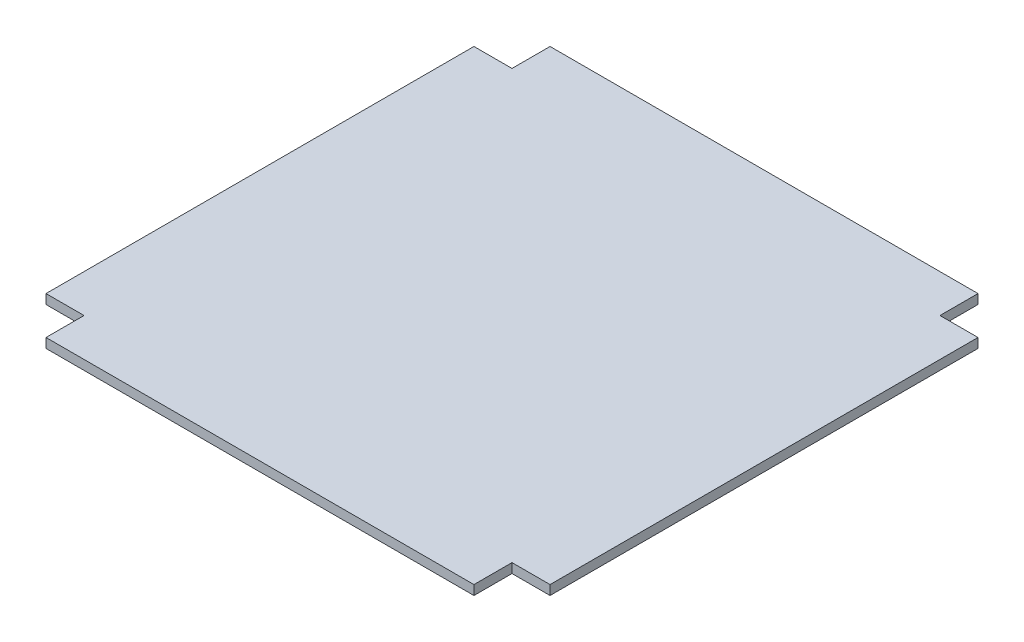
ISO-10303-21;
HEADER;
FILE_DESCRIPTION(('STEP AP214'),'2;1');
FILE_NAME('part.step','',(''),(''),'','','');
FILE_SCHEMA(('AUTOMOTIVE_DESIGN { 1 0 10303 214 1 1 1 1 }'));
ENDSEC;
DATA;
#1=APPLICATION_CONTEXT('core data for automotive mechanical design processes');
#2=APPLICATION_PROTOCOL_DEFINITION('international standard','automotive_design',2000,#1);
#3=PRODUCT_CONTEXT('',#1,'mechanical');
#4=PRODUCT('Part','Part','',(#3));
#5=PRODUCT_RELATED_PRODUCT_CATEGORY('part','',(#4));
#6=PRODUCT_DEFINITION_FORMATION('','',#4);
#7=PRODUCT_DEFINITION_CONTEXT('part definition',#1,'design');
#8=PRODUCT_DEFINITION('design','',#6,#7);
#9=PRODUCT_DEFINITION_SHAPE('','',#8);
#10=(LENGTH_UNIT() NAMED_UNIT(*) SI_UNIT(.MILLI.,.METRE.));
#11=(NAMED_UNIT(*) PLANE_ANGLE_UNIT() SI_UNIT($,.RADIAN.));
#12=(NAMED_UNIT(*) SI_UNIT($,.STERADIAN.) SOLID_ANGLE_UNIT());
#13=UNCERTAINTY_MEASURE_WITH_UNIT(LENGTH_MEASURE(1.E-05),#10,'distance_accuracy_value','');
#14=(GEOMETRIC_REPRESENTATION_CONTEXT(3) GLOBAL_UNCERTAINTY_ASSIGNED_CONTEXT((#13)) GLOBAL_UNIT_ASSIGNED_CONTEXT((#10,
#11,#12)) REPRESENTATION_CONTEXT('',''));
#15=CARTESIAN_POINT('',(0.,0.,0.));
#16=DIRECTION('',(0.,0.,1.));
#17=DIRECTION('',(1.,0.,0.));
#18=AXIS2_PLACEMENT_3D('',#15,#16,#17);
#19=CARTESIAN_POINT('',(265.,10.,265.));
#20=DIRECTION('',(-1.,0.,0.));
#21=DIRECTION('',(0.,0.,1.));
#22=AXIS2_PLACEMENT_3D('',#19,#20,#21);
#23=PLANE('',#22);
#24=DIRECTION('',(0.,0.,-1.));
#25=VECTOR('',#24,1.);
#26=CARTESIAN_POINT('',(265.,0.,265.));
#27=LINE('',#26,#25);
#28=CARTESIAN_POINT('',(265.,0.,225.));
#29=VERTEX_POINT('',#28);
#30=CARTESIAN_POINT('',(265.,0.,-225.));
#31=VERTEX_POINT('',#30);
#32=EDGE_CURVE('E144',#29,#31,#27,.T.);
#33=ORIENTED_EDGE('',*,*,#32,.T.);
#34=DIRECTION('',(0.,1.,0.));
#35=VECTOR('',#34,1.);
#36=CARTESIAN_POINT('',(265.,0.,-225.));
#37=LINE('',#36,#35);
#38=CARTESIAN_POINT('',(265.,10.,-225.));
#39=VERTEX_POINT('',#38);
#40=EDGE_CURVE('E211',#31,#39,#37,.T.);
#41=ORIENTED_EDGE('',*,*,#40,.T.);
#42=DIRECTION('',(0.,0.,-1.));
#43=VECTOR('',#42,1.);
#44=CARTESIAN_POINT('',(265.,10.,265.));
#45=LINE('',#44,#43);
#46=CARTESIAN_POINT('',(265.,10.,225.));
#47=VERTEX_POINT('',#46);
#48=EDGE_CURVE('E146',#47,#39,#45,.T.);
#49=ORIENTED_EDGE('',*,*,#48,.F.);
#50=DIRECTION('',(0.,1.,0.));
#51=VECTOR('',#50,1.);
#52=CARTESIAN_POINT('',(265.,0.,225.));
#53=LINE('',#52,#51);
#54=EDGE_CURVE('E131',#29,#47,#53,.T.);
#55=ORIENTED_EDGE('',*,*,#54,.F.);
#56=EDGE_LOOP('',(#33,#41,#49,#55));
#57=FACE_BOUND('',#56,.T.);
#58=ADVANCED_FACE('F37',(#57),#23,.F.);
#59=CARTESIAN_POINT('',(-265.,10.,-265.));
#60=DIRECTION('',(0.,0.,1.));
#61=DIRECTION('',(1.,0.,0.));
#62=AXIS2_PLACEMENT_3D('',#59,#60,#61);
#63=PLANE('',#62);
#64=DIRECTION('',(-1.,0.,0.));
#65=VECTOR('',#64,1.);
#66=CARTESIAN_POINT('',(-265.,10.,-265.));
#67=LINE('',#66,#65);
#68=CARTESIAN_POINT('',(225.,10.,-265.));
#69=VERTEX_POINT('',#68);
#70=CARTESIAN_POINT('',(-225.,10.,-265.));
#71=VERTEX_POINT('',#70);
#72=EDGE_CURVE('E170',#69,#71,#67,.T.);
#73=ORIENTED_EDGE('',*,*,#72,.F.);
#74=DIRECTION('',(0.,1.,0.));
#75=VECTOR('',#74,1.);
#76=CARTESIAN_POINT('',(225.,0.,-265.));
#77=LINE('',#76,#75);
#78=CARTESIAN_POINT('',(225.,0.,-265.));
#79=VERTEX_POINT('',#78);
#80=EDGE_CURVE('E234',#79,#69,#77,.T.);
#81=ORIENTED_EDGE('',*,*,#80,.F.);
#82=DIRECTION('',(-1.,0.,0.));
#83=VECTOR('',#82,1.);
#84=CARTESIAN_POINT('',(-265.,0.,-265.));
#85=LINE('',#84,#83);
#86=CARTESIAN_POINT('',(-225.,0.,-265.));
#87=VERTEX_POINT('',#86);
#88=EDGE_CURVE('E150',#79,#87,#85,.T.);
#89=ORIENTED_EDGE('',*,*,#88,.T.);
#90=DIRECTION('',(0.,1.,0.));
#91=VECTOR('',#90,1.);
#92=CARTESIAN_POINT('',(-225.,0.,-265.));
#93=LINE('',#92,#91);
#94=EDGE_CURVE('E151',#87,#71,#93,.T.);
#95=ORIENTED_EDGE('',*,*,#94,.T.);
#96=EDGE_LOOP('',(#73,#81,#89,#95));
#97=FACE_BOUND('',#96,.T.);
#98=ADVANCED_FACE('F245',(#97),#63,.F.);
#99=CARTESIAN_POINT('',(-265.,10.,265.));
#100=DIRECTION('',(1.,0.,0.));
#101=DIRECTION('',(0.,0.,-1.));
#102=AXIS2_PLACEMENT_3D('',#99,#100,#101);
#103=PLANE('',#102);
#104=DIRECTION('',(0.,0.,1.));
#105=VECTOR('',#104,1.);
#106=CARTESIAN_POINT('',(-265.,0.,265.));
#107=LINE('',#106,#105);
#108=CARTESIAN_POINT('',(-265.,0.,-225.));
#109=VERTEX_POINT('',#108);
#110=CARTESIAN_POINT('',(-265.,0.,225.));
#111=VERTEX_POINT('',#110);
#112=EDGE_CURVE('E154',#109,#111,#107,.T.);
#113=ORIENTED_EDGE('',*,*,#112,.T.);
#114=DIRECTION('',(0.,1.,0.));
#115=VECTOR('',#114,1.);
#116=CARTESIAN_POINT('',(-265.,0.,225.));
#117=LINE('',#116,#115);
#118=CARTESIAN_POINT('',(-265.,10.,225.));
#119=VERTEX_POINT('',#118);
#120=EDGE_CURVE('E190',#111,#119,#117,.T.);
#121=ORIENTED_EDGE('',*,*,#120,.T.);
#122=DIRECTION('',(0.,0.,1.));
#123=VECTOR('',#122,1.);
#124=CARTESIAN_POINT('',(-265.,10.,265.));
#125=LINE('',#124,#123);
#126=CARTESIAN_POINT('',(-265.,10.,-225.));
#127=VERTEX_POINT('',#126);
#128=EDGE_CURVE('E45',#127,#119,#125,.T.);
#129=ORIENTED_EDGE('',*,*,#128,.F.);
#130=DIRECTION('',(0.,1.,0.));
#131=VECTOR('',#130,1.);
#132=CARTESIAN_POINT('',(-265.,0.,-225.));
#133=LINE('',#132,#131);
#134=EDGE_CURVE('E177',#109,#127,#133,.T.);
#135=ORIENTED_EDGE('',*,*,#134,.F.);
#136=EDGE_LOOP('',(#113,#121,#129,#135));
#137=FACE_BOUND('',#136,.T.);
#138=ADVANCED_FACE('F189',(#137),#103,.F.);
#139=CARTESIAN_POINT('',(-265.,10.,265.));
#140=DIRECTION('',(0.,0.,-1.));
#141=DIRECTION('',(-1.,0.,0.));
#142=AXIS2_PLACEMENT_3D('',#139,#140,#141);
#143=PLANE('',#142);
#144=DIRECTION('',(1.,0.,0.));
#145=VECTOR('',#144,1.);
#146=CARTESIAN_POINT('',(-265.,10.,265.));
#147=LINE('',#146,#145);
#148=CARTESIAN_POINT('',(-225.,10.,265.));
#149=VERTEX_POINT('',#148);
#150=CARTESIAN_POINT('',(225.,10.,265.));
#151=VERTEX_POINT('',#150);
#152=EDGE_CURVE('E11',#149,#151,#147,.T.);
#153=ORIENTED_EDGE('',*,*,#152,.F.);
#154=DIRECTION('',(0.,1.,0.));
#155=VECTOR('',#154,1.);
#156=CARTESIAN_POINT('',(-225.,0.,265.));
#157=LINE('',#156,#155);
#158=CARTESIAN_POINT('',(-225.,0.,265.));
#159=VERTEX_POINT('',#158);
#160=EDGE_CURVE('E197',#159,#149,#157,.T.);
#161=ORIENTED_EDGE('',*,*,#160,.F.);
#162=DIRECTION('',(1.,0.,0.));
#163=VECTOR('',#162,1.);
#164=CARTESIAN_POINT('',(-265.,0.,265.));
#165=LINE('',#164,#163);
#166=CARTESIAN_POINT('',(225.,0.,265.));
#167=VERTEX_POINT('',#166);
#168=EDGE_CURVE('E40',#159,#167,#165,.T.);
#169=ORIENTED_EDGE('',*,*,#168,.T.);
#170=DIRECTION('',(0.,1.,0.));
#171=VECTOR('',#170,1.);
#172=CARTESIAN_POINT('',(225.,0.,265.));
#173=LINE('',#172,#171);
#174=EDGE_CURVE('E224',#167,#151,#173,.T.);
#175=ORIENTED_EDGE('',*,*,#174,.T.);
#176=EDGE_LOOP('',(#153,#161,#169,#175));
#177=FACE_BOUND('',#176,.T.);
#178=ADVANCED_FACE('F264',(#177),#143,.F.);
#179=CARTESIAN_POINT('',(0.,10.,0.));
#180=DIRECTION('',(0.,-1.,0.));
#181=DIRECTION('',(0.,0.,-1.));
#182=AXIS2_PLACEMENT_3D('',#179,#180,#181);
#183=PLANE('',#182);
#184=ORIENTED_EDGE('',*,*,#48,.T.);
#185=DIRECTION('',(1.,0.,0.));
#186=VECTOR('',#185,1.);
#187=CARTESIAN_POINT('',(265.,10.,-225.));
#188=LINE('',#187,#186);
#189=CARTESIAN_POINT('',(225.,10.,-225.));
#190=VERTEX_POINT('',#189);
#191=EDGE_CURVE('E195',#190,#39,#188,.T.);
#192=ORIENTED_EDGE('',*,*,#191,.F.);
#193=DIRECTION('',(0.,0.,1.));
#194=VECTOR('',#193,1.);
#195=CARTESIAN_POINT('',(225.,10.,-265.));
#196=LINE('',#195,#194);
#197=EDGE_CURVE('E191',#69,#190,#196,.T.);
#198=ORIENTED_EDGE('',*,*,#197,.F.);
#199=ORIENTED_EDGE('',*,*,#72,.T.);
#200=DIRECTION('',(0.,0.,-1.));
#201=VECTOR('',#200,1.);
#202=CARTESIAN_POINT('',(-225.,10.,-265.));
#203=LINE('',#202,#201);
#204=CARTESIAN_POINT('',(-225.,10.,-225.));
#205=VERTEX_POINT('',#204);
#206=EDGE_CURVE('E207',#205,#71,#203,.T.);
#207=ORIENTED_EDGE('',*,*,#206,.F.);
#208=DIRECTION('',(1.,0.,0.));
#209=VECTOR('',#208,1.);
#210=CARTESIAN_POINT('',(-265.,10.,-225.));
#211=LINE('',#210,#209);
#212=EDGE_CURVE('E188',#127,#205,#211,.T.);
#213=ORIENTED_EDGE('',*,*,#212,.F.);
#214=ORIENTED_EDGE('',*,*,#128,.T.);
#215=DIRECTION('',(-1.,0.,0.));
#216=VECTOR('',#215,1.);
#217=CARTESIAN_POINT('',(-265.,10.,225.));
#218=LINE('',#217,#216);
#219=CARTESIAN_POINT('',(-225.,10.,225.));
#220=VERTEX_POINT('',#219);
#221=EDGE_CURVE('E185',#220,#119,#218,.T.);
#222=ORIENTED_EDGE('',*,*,#221,.F.);
#223=DIRECTION('',(0.,0.,-1.));
#224=VECTOR('',#223,1.);
#225=CARTESIAN_POINT('',(-225.,10.,265.));
#226=LINE('',#225,#224);
#227=EDGE_CURVE('E222',#149,#220,#226,.T.);
#228=ORIENTED_EDGE('',*,*,#227,.F.);
#229=ORIENTED_EDGE('',*,*,#152,.T.);
#230=DIRECTION('',(0.,0.,1.));
#231=VECTOR('',#230,1.);
#232=CARTESIAN_POINT('',(225.,10.,265.));
#233=LINE('',#232,#231);
#234=CARTESIAN_POINT('',(225.,10.,225.));
#235=VERTEX_POINT('',#234);
#236=EDGE_CURVE('E138',#235,#151,#233,.T.);
#237=ORIENTED_EDGE('',*,*,#236,.F.);
#238=DIRECTION('',(-1.,0.,0.));
#239=VECTOR('',#238,1.);
#240=CARTESIAN_POINT('',(265.,10.,225.));
#241=LINE('',#240,#239);
#242=EDGE_CURVE('E344',#47,#235,#241,.T.);
#243=ORIENTED_EDGE('',*,*,#242,.F.);
#244=EDGE_LOOP('',(#184,#192,#198,#199,#207,#213,#214,#222,#228,#229,#237,#243));
#245=FACE_BOUND('',#244,.T.);
#246=ADVANCED_FACE('F183',(#245),#183,.F.);
#247=CARTESIAN_POINT('',(0.,0.,0.));
#248=DIRECTION('',(0.,-1.,0.));
#249=DIRECTION('',(0.,0.,-1.));
#250=AXIS2_PLACEMENT_3D('',#247,#248,#249);
#251=PLANE('',#250);
#252=DIRECTION('',(1.,0.,0.));
#253=VECTOR('',#252,1.);
#254=CARTESIAN_POINT('',(265.,0.,-225.));
#255=LINE('',#254,#253);
#256=CARTESIAN_POINT('',(225.,0.,-225.));
#257=VERTEX_POINT('',#256);
#258=EDGE_CURVE('E53',#257,#31,#255,.T.);
#259=ORIENTED_EDGE('',*,*,#258,.T.);
#260=ORIENTED_EDGE('',*,*,#32,.F.);
#261=DIRECTION('',(-1.,0.,0.));
#262=VECTOR('',#261,1.);
#263=CARTESIAN_POINT('',(265.,0.,225.));
#264=LINE('',#263,#262);
#265=CARTESIAN_POINT('',(225.,0.,225.));
#266=VERTEX_POINT('',#265);
#267=EDGE_CURVE('E127',#29,#266,#264,.T.);
#268=ORIENTED_EDGE('',*,*,#267,.T.);
#269=DIRECTION('',(0.,0.,1.));
#270=VECTOR('',#269,1.);
#271=CARTESIAN_POINT('',(225.,0.,265.));
#272=LINE('',#271,#270);
#273=EDGE_CURVE('E137',#266,#167,#272,.T.);
#274=ORIENTED_EDGE('',*,*,#273,.T.);
#275=ORIENTED_EDGE('',*,*,#168,.F.);
#276=DIRECTION('',(0.,0.,-1.));
#277=VECTOR('',#276,1.);
#278=CARTESIAN_POINT('',(-225.,0.,265.));
#279=LINE('',#278,#277);
#280=CARTESIAN_POINT('',(-225.,0.,225.));
#281=VERTEX_POINT('',#280);
#282=EDGE_CURVE('E218',#159,#281,#279,.T.);
#283=ORIENTED_EDGE('',*,*,#282,.T.);
#284=DIRECTION('',(-1.,0.,0.));
#285=VECTOR('',#284,1.);
#286=CARTESIAN_POINT('',(-265.,0.,225.));
#287=LINE('',#286,#285);
#288=EDGE_CURVE('E61',#281,#111,#287,.T.);
#289=ORIENTED_EDGE('',*,*,#288,.T.);
#290=ORIENTED_EDGE('',*,*,#112,.F.);
#291=DIRECTION('',(1.,0.,0.));
#292=VECTOR('',#291,1.);
#293=CARTESIAN_POINT('',(-265.,0.,-225.));
#294=LINE('',#293,#292);
#295=CARTESIAN_POINT('',(-225.,0.,-225.));
#296=VERTEX_POINT('',#295);
#297=EDGE_CURVE('E203',#109,#296,#294,.T.);
#298=ORIENTED_EDGE('',*,*,#297,.T.);
#299=DIRECTION('',(0.,0.,-1.));
#300=VECTOR('',#299,1.);
#301=CARTESIAN_POINT('',(-225.,0.,-265.));
#302=LINE('',#301,#300);
#303=EDGE_CURVE('E206',#296,#87,#302,.T.);
#304=ORIENTED_EDGE('',*,*,#303,.T.);
#305=ORIENTED_EDGE('',*,*,#88,.F.);
#306=DIRECTION('',(0.,0.,1.));
#307=VECTOR('',#306,1.);
#308=CARTESIAN_POINT('',(225.,0.,-265.));
#309=LINE('',#308,#307);
#310=EDGE_CURVE('E232',#79,#257,#309,.T.);
#311=ORIENTED_EDGE('',*,*,#310,.T.);
#312=EDGE_LOOP('',(#259,#260,#268,#274,#275,#283,#289,#290,#298,#304,#305,#311));
#313=FACE_BOUND('',#312,.T.);
#314=ADVANCED_FACE('F148',(#313),#251,.T.);
#315=CARTESIAN_POINT('',(-225.,0.,-265.));
#316=DIRECTION('',(1.,0.,0.));
#317=DIRECTION('',(0.,0.,-1.));
#318=AXIS2_PLACEMENT_3D('',#315,#316,#317);
#319=PLANE('',#318);
#320=ORIENTED_EDGE('',*,*,#206,.T.);
#321=ORIENTED_EDGE('',*,*,#94,.F.);
#322=ORIENTED_EDGE('',*,*,#303,.F.);
#323=DIRECTION('',(0.,1.,0.));
#324=VECTOR('',#323,1.);
#325=CARTESIAN_POINT('',(-225.,0.,-225.));
#326=LINE('',#325,#324);
#327=EDGE_CURVE('E157',#296,#205,#326,.T.);
#328=ORIENTED_EDGE('',*,*,#327,.T.);
#329=EDGE_LOOP('',(#320,#321,#322,#328));
#330=FACE_BOUND('',#329,.T.);
#331=ADVANCED_FACE('F246',(#330),#319,.F.);
#332=CARTESIAN_POINT('',(-265.,0.,-225.));
#333=DIRECTION('',(0.,0.,1.));
#334=DIRECTION('',(1.,0.,0.));
#335=AXIS2_PLACEMENT_3D('',#332,#333,#334);
#336=PLANE('',#335);
#337=ORIENTED_EDGE('',*,*,#212,.T.);
#338=ORIENTED_EDGE('',*,*,#327,.F.);
#339=ORIENTED_EDGE('',*,*,#297,.F.);
#340=ORIENTED_EDGE('',*,*,#134,.T.);
#341=EDGE_LOOP('',(#337,#338,#339,#340));
#342=FACE_BOUND('',#341,.T.);
#343=ADVANCED_FACE('F215',(#342),#336,.F.);
#344=CARTESIAN_POINT('',(225.,0.,265.));
#345=DIRECTION('',(-1.,0.,0.));
#346=DIRECTION('',(0.,0.,1.));
#347=AXIS2_PLACEMENT_3D('',#344,#345,#346);
#348=PLANE('',#347);
#349=ORIENTED_EDGE('',*,*,#236,.T.);
#350=ORIENTED_EDGE('',*,*,#174,.F.);
#351=ORIENTED_EDGE('',*,*,#273,.F.);
#352=DIRECTION('',(0.,1.,0.));
#353=VECTOR('',#352,1.);
#354=CARTESIAN_POINT('',(225.,0.,225.));
#355=LINE('',#354,#353);
#356=EDGE_CURVE('E133',#266,#235,#355,.T.);
#357=ORIENTED_EDGE('',*,*,#356,.T.);
#358=EDGE_LOOP('',(#349,#350,#351,#357));
#359=FACE_BOUND('',#358,.T.);
#360=ADVANCED_FACE('F253',(#359),#348,.F.);
#361=CARTESIAN_POINT('',(265.,0.,225.));
#362=DIRECTION('',(0.,0.,-1.));
#363=DIRECTION('',(-1.,0.,0.));
#364=AXIS2_PLACEMENT_3D('',#361,#362,#363);
#365=PLANE('',#364);
#366=ORIENTED_EDGE('',*,*,#242,.T.);
#367=ORIENTED_EDGE('',*,*,#356,.F.);
#368=ORIENTED_EDGE('',*,*,#267,.F.);
#369=ORIENTED_EDGE('',*,*,#54,.T.);
#370=EDGE_LOOP('',(#366,#367,#368,#369));
#371=FACE_BOUND('',#370,.T.);
#372=ADVANCED_FACE('F130',(#371),#365,.F.);
#373=CARTESIAN_POINT('',(-265.,0.,225.));
#374=DIRECTION('',(0.,0.,-1.));
#375=DIRECTION('',(-1.,0.,0.));
#376=AXIS2_PLACEMENT_3D('',#373,#374,#375);
#377=PLANE('',#376);
#378=ORIENTED_EDGE('',*,*,#221,.T.);
#379=ORIENTED_EDGE('',*,*,#120,.F.);
#380=ORIENTED_EDGE('',*,*,#288,.F.);
#381=DIRECTION('',(0.,1.,0.));
#382=VECTOR('',#381,1.);
#383=CARTESIAN_POINT('',(-225.,0.,225.));
#384=LINE('',#383,#382);
#385=EDGE_CURVE('E192',#281,#220,#384,.T.);
#386=ORIENTED_EDGE('',*,*,#385,.T.);
#387=EDGE_LOOP('',(#378,#379,#380,#386));
#388=FACE_BOUND('',#387,.T.);
#389=ADVANCED_FACE('F306',(#388),#377,.F.);
#390=CARTESIAN_POINT('',(-225.,0.,265.));
#391=DIRECTION('',(1.,0.,0.));
#392=DIRECTION('',(0.,0.,-1.));
#393=AXIS2_PLACEMENT_3D('',#390,#391,#392);
#394=PLANE('',#393);
#395=ORIENTED_EDGE('',*,*,#227,.T.);
#396=ORIENTED_EDGE('',*,*,#385,.F.);
#397=ORIENTED_EDGE('',*,*,#282,.F.);
#398=ORIENTED_EDGE('',*,*,#160,.T.);
#399=EDGE_LOOP('',(#395,#396,#397,#398));
#400=FACE_BOUND('',#399,.T.);
#401=ADVANCED_FACE('F315',(#400),#394,.F.);
#402=CARTESIAN_POINT('',(265.,0.,-225.));
#403=DIRECTION('',(0.,0.,1.));
#404=DIRECTION('',(1.,0.,0.));
#405=AXIS2_PLACEMENT_3D('',#402,#403,#404);
#406=PLANE('',#405);
#407=ORIENTED_EDGE('',*,*,#191,.T.);
#408=ORIENTED_EDGE('',*,*,#40,.F.);
#409=ORIENTED_EDGE('',*,*,#258,.F.);
#410=DIRECTION('',(0.,1.,0.));
#411=VECTOR('',#410,1.);
#412=CARTESIAN_POINT('',(225.,0.,-225.));
#413=LINE('',#412,#411);
#414=EDGE_CURVE('E238',#257,#190,#413,.T.);
#415=ORIENTED_EDGE('',*,*,#414,.T.);
#416=EDGE_LOOP('',(#407,#408,#409,#415));
#417=FACE_BOUND('',#416,.T.);
#418=ADVANCED_FACE('F324',(#417),#406,.F.);
#419=CARTESIAN_POINT('',(225.,0.,-265.));
#420=DIRECTION('',(-1.,0.,0.));
#421=DIRECTION('',(0.,0.,1.));
#422=AXIS2_PLACEMENT_3D('',#419,#420,#421);
#423=PLANE('',#422);
#424=ORIENTED_EDGE('',*,*,#197,.T.);
#425=ORIENTED_EDGE('',*,*,#414,.F.);
#426=ORIENTED_EDGE('',*,*,#310,.F.);
#427=ORIENTED_EDGE('',*,*,#80,.T.);
#428=EDGE_LOOP('',(#424,#425,#426,#427));
#429=FACE_BOUND('',#428,.T.);
#430=ADVANCED_FACE('F242',(#429),#423,.F.);
#431=CLOSED_SHELL('',(#58,#98,#138,#178,#246,#314,#331,#343,#360,#372,#389,#401,#418,#430));
#432=MANIFOLD_SOLID_BREP('B2',#431);
#433=ADVANCED_BREP_SHAPE_REPRESENTATION('',(#18,#432),#14);
#434=SHAPE_DEFINITION_REPRESENTATION(#9,#433);
ENDSEC;
END-ISO-10303-21;
